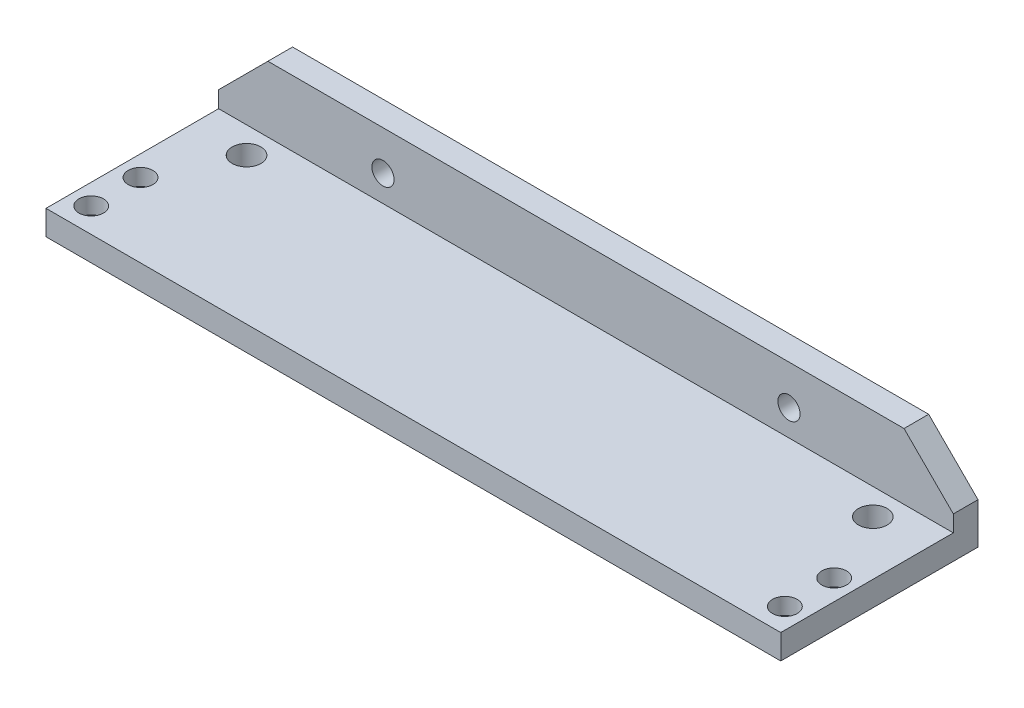
ISO-10303-21;
HEADER;
FILE_DESCRIPTION(('STEP AP214'),'2;1');
FILE_NAME('part.step','',(''),(''),'','','');
FILE_SCHEMA(('AUTOMOTIVE_DESIGN { 1 0 10303 214 1 1 1 1 }'));
ENDSEC;
DATA;
#1=APPLICATION_CONTEXT('core data for automotive mechanical design processes');
#2=APPLICATION_PROTOCOL_DEFINITION('international standard','automotive_design',2000,#1);
#3=PRODUCT_CONTEXT('',#1,'mechanical');
#4=PRODUCT('Part','Part','',(#3));
#5=PRODUCT_RELATED_PRODUCT_CATEGORY('part','',(#4));
#6=PRODUCT_DEFINITION_FORMATION('','',#4);
#7=PRODUCT_DEFINITION_CONTEXT('part definition',#1,'design');
#8=PRODUCT_DEFINITION('design','',#6,#7);
#9=PRODUCT_DEFINITION_SHAPE('','',#8);
#10=(LENGTH_UNIT() NAMED_UNIT(*) SI_UNIT(.MILLI.,.METRE.));
#11=(NAMED_UNIT(*) PLANE_ANGLE_UNIT() SI_UNIT($,.RADIAN.));
#12=(NAMED_UNIT(*) SI_UNIT($,.STERADIAN.) SOLID_ANGLE_UNIT());
#13=UNCERTAINTY_MEASURE_WITH_UNIT(LENGTH_MEASURE(1.E-05),#10,'distance_accuracy_value','');
#14=(GEOMETRIC_REPRESENTATION_CONTEXT(3) GLOBAL_UNCERTAINTY_ASSIGNED_CONTEXT((#13)) GLOBAL_UNIT_ASSIGNED_CONTEXT((#10,
#11,#12)) REPRESENTATION_CONTEXT('',''));
#15=CARTESIAN_POINT('',(0.,0.,0.));
#16=DIRECTION('',(0.,0.,1.));
#17=DIRECTION('',(1.,0.,0.));
#18=AXIS2_PLACEMENT_3D('',#15,#16,#17);
#19=CARTESIAN_POINT('',(0.,-2.10740038617406,24.));
#20=DIRECTION('',(0.,1.,0.));
#21=DIRECTION('',(0.,0.,1.));
#22=AXIS2_PLACEMENT_3D('',#19,#20,#21);
#23=PLANE('',#22);
#24=CARTESIAN_POINT('',(48.6489300998573,-2.10740038617406,15.));
#25=DIRECTION('',(0.,1.,0.));
#26=DIRECTION('',(0.,0.,1.));
#27=AXIS2_PLACEMENT_3D('',#24,#25,#26);
#28=CIRCLE('',#27,2.25);
#29=CARTESIAN_POINT('',(48.6489300998573,-2.10740038617406,17.25));
#30=VERTEX_POINT('',#29);
#31=EDGE_CURVE('E599',#30,#30,#28,.T.);
#32=ORIENTED_EDGE('',*,*,#31,.T.);
#33=EDGE_LOOP('',(#32));
#34=FACE_BOUND('',#33,.T.);
#35=CARTESIAN_POINT('',(-35.7510699001427,-2.10740038617406,15.));
#36=DIRECTION('',(0.,1.,0.));
#37=DIRECTION('',(0.,0.,1.));
#38=AXIS2_PLACEMENT_3D('',#35,#36,#37);
#39=CIRCLE('',#38,2.25);
#40=CARTESIAN_POINT('',(-35.7510699001427,-2.10740038617406,17.25));
#41=VERTEX_POINT('',#40);
#42=EDGE_CURVE('E159',#41,#41,#39,.T.);
#43=ORIENTED_EDGE('',*,*,#42,.T.);
#44=EDGE_LOOP('',(#43));
#45=FACE_BOUND('',#44,.T.);
#46=CARTESIAN_POINT('',(44.5489300998573,-2.10740038617406,6.2));
#47=DIRECTION('',(0.,1.,0.));
#48=DIRECTION('',(0.,0.,1.));
#49=AXIS2_PLACEMENT_3D('',#46,#47,#48);
#50=CIRCLE('',#49,1.75);
#51=CARTESIAN_POINT('',(44.5489300998573,-2.10740038617406,7.95));
#52=VERTEX_POINT('',#51);
#53=EDGE_CURVE('E174',#52,#52,#50,.F.);
#54=ORIENTED_EDGE('',*,*,#53,.F.);
#55=EDGE_LOOP('',(#54));
#56=FACE_BOUND('',#55,.T.);
#57=CARTESIAN_POINT('',(-31.6510699001427,-2.10740038617406,6.2));
#58=DIRECTION('',(0.,1.,0.));
#59=DIRECTION('',(0.,0.,1.));
#60=AXIS2_PLACEMENT_3D('',#57,#58,#59);
#61=CIRCLE('',#60,1.75);
#62=CARTESIAN_POINT('',(-31.6510699001427,-2.10740038617406,7.95));
#63=VERTEX_POINT('',#62);
#64=EDGE_CURVE('E157',#63,#63,#61,.F.);
#65=ORIENTED_EDGE('',*,*,#64,.F.);
#66=EDGE_LOOP('',(#65));
#67=FACE_BOUND('',#66,.T.);
#68=DIRECTION('',(1.,0.,0.));
#69=VECTOR('',#68,1.);
#70=CARTESIAN_POINT('',(0.,-2.10740038617406,0.));
#71=LINE('',#70,#69);
#72=CARTESIAN_POINT('',(-38.2510699001427,-2.10740038617406,0.));
#73=VERTEX_POINT('',#72);
#74=CARTESIAN_POINT('',(51.1489300998573,-2.10740038617406,0.));
#75=VERTEX_POINT('',#74);
#76=EDGE_CURVE('E192',#73,#75,#71,.T.);
#77=ORIENTED_EDGE('',*,*,#76,.T.);
#78=DIRECTION('',(0.,0.,-1.));
#79=VECTOR('',#78,1.);
#80=CARTESIAN_POINT('',(51.1489300998573,-2.10740038617406,24.));
#81=LINE('',#80,#79);
#82=CARTESIAN_POINT('',(51.1489300998573,-2.10740038617406,24.));
#83=VERTEX_POINT('',#82);
#84=EDGE_CURVE('E136',#83,#75,#81,.T.);
#85=ORIENTED_EDGE('',*,*,#84,.F.);
#86=DIRECTION('',(1.,0.,0.));
#87=VECTOR('',#86,1.);
#88=CARTESIAN_POINT('',(0.,-2.10740038617406,24.));
#89=LINE('',#88,#87);
#90=CARTESIAN_POINT('',(-38.2510699001427,-2.10740038617406,24.));
#91=VERTEX_POINT('',#90);
#92=EDGE_CURVE('E193',#91,#83,#89,.T.);
#93=ORIENTED_EDGE('',*,*,#92,.F.);
#94=DIRECTION('',(0.,0.,-1.));
#95=VECTOR('',#94,1.);
#96=CARTESIAN_POINT('',(-38.2510699001427,-2.10740038617406,24.));
#97=LINE('',#96,#95);
#98=EDGE_CURVE('E204',#91,#73,#97,.T.);
#99=ORIENTED_EDGE('',*,*,#98,.T.);
#100=EDGE_LOOP('',(#77,#85,#93,#99));
#101=FACE_BOUND('',#100,.T.);
#102=CARTESIAN_POINT('',(48.6489300998573,-2.10740038617406,21.));
#103=DIRECTION('',(0.,1.,0.));
#104=DIRECTION('',(0.,0.,1.));
#105=AXIS2_PLACEMENT_3D('',#102,#103,#104);
#106=CIRCLE('',#105,2.25);
#107=CARTESIAN_POINT('',(48.6489300998573,-2.10740038617406,23.25));
#108=VERTEX_POINT('',#107);
#109=EDGE_CURVE('E602',#108,#108,#106,.T.);
#110=ORIENTED_EDGE('',*,*,#109,.T.);
#111=EDGE_LOOP('',(#110));
#112=FACE_BOUND('',#111,.T.);
#113=CARTESIAN_POINT('',(-35.7510699001427,-2.10740038617406,21.));
#114=DIRECTION('',(0.,1.,0.));
#115=DIRECTION('',(0.,0.,1.));
#116=AXIS2_PLACEMENT_3D('',#113,#114,#115);
#117=CIRCLE('',#116,2.25);
#118=CARTESIAN_POINT('',(-35.7510699001427,-2.10740038617406,23.25));
#119=VERTEX_POINT('',#118);
#120=EDGE_CURVE('E590',#119,#119,#117,.T.);
#121=ORIENTED_EDGE('',*,*,#120,.T.);
#122=EDGE_LOOP('',(#121));
#123=FACE_BOUND('',#122,.T.);
#124=ADVANCED_FACE('F50',(#34,#45,#56,#67,#101,#112,#123),#23,.F.);
#125=CARTESIAN_POINT('',(51.1489300998573,0.,3.));
#126=DIRECTION('',(-1.,0.,0.));
#127=DIRECTION('',(0.,0.,1.));
#128=AXIS2_PLACEMENT_3D('',#125,#126,#127);
#129=PLANE('',#128);
#130=DIRECTION('',(0.,1.,0.));
#131=VECTOR('',#130,1.);
#132=CARTESIAN_POINT('',(51.1489300998573,0.,0.));
#133=LINE('',#132,#131);
#134=CARTESIAN_POINT('',(51.1489300998573,2.89259961382594,0.));
#135=VERTEX_POINT('',#134);
#136=EDGE_CURVE('E139',#75,#135,#133,.T.);
#137=ORIENTED_EDGE('',*,*,#136,.T.);
#138=DIRECTION('',(0.,0.,-1.));
#139=VECTOR('',#138,1.);
#140=CARTESIAN_POINT('',(51.1489300998573,2.89259961382594,3.));
#141=LINE('',#140,#139);
#142=CARTESIAN_POINT('',(51.1489300998573,2.89259961382594,3.));
#143=VERTEX_POINT('',#142);
#144=EDGE_CURVE('E12',#143,#135,#141,.T.);
#145=ORIENTED_EDGE('',*,*,#144,.F.);
#146=DIRECTION('',(0.,1.,0.));
#147=VECTOR('',#146,1.);
#148=CARTESIAN_POINT('',(51.1489300998573,0.,3.));
#149=LINE('',#148,#147);
#150=CARTESIAN_POINT('',(51.1489300998573,0.892599613825941,3.));
#151=VERTEX_POINT('',#150);
#152=EDGE_CURVE('E220',#151,#143,#149,.T.);
#153=ORIENTED_EDGE('',*,*,#152,.F.);
#154=DIRECTION('',(0.,0.,-1.));
#155=VECTOR('',#154,1.);
#156=CARTESIAN_POINT('',(51.1489300998573,0.892599613825941,24.));
#157=LINE('',#156,#155);
#158=CARTESIAN_POINT('',(51.1489300998573,0.892599613825941,24.));
#159=VERTEX_POINT('',#158);
#160=EDGE_CURVE('E69',#159,#151,#157,.T.);
#161=ORIENTED_EDGE('',*,*,#160,.F.);
#162=DIRECTION('',(0.,1.,0.));
#163=VECTOR('',#162,1.);
#164=CARTESIAN_POINT('',(51.1489300998573,0.,24.));
#165=LINE('',#164,#163);
#166=EDGE_CURVE('E196',#83,#159,#165,.T.);
#167=ORIENTED_EDGE('',*,*,#166,.F.);
#168=ORIENTED_EDGE('',*,*,#84,.T.);
#169=EDGE_LOOP('',(#137,#145,#153,#161,#167,#168));
#170=FACE_BOUND('',#169,.T.);
#171=ADVANCED_FACE('F224',(#170),#129,.F.);
#172=CARTESIAN_POINT('',(27.0207648568417,27.0207648568416,3.));
#173=DIRECTION('',(-0.707106781186548,-0.707106781186547,0.));
#174=DIRECTION('',(0.707106781186547,-0.707106781186548,0.));
#175=AXIS2_PLACEMENT_3D('',#172,#173,#174);
#176=PLANE('',#175);
#177=DIRECTION('',(-0.707106781186547,0.707106781186548,0.));
#178=VECTOR('',#177,1.);
#179=CARTESIAN_POINT('',(27.0207648568417,27.0207648568416,0.));
#180=LINE('',#179,#178);
#181=CARTESIAN_POINT('',(45.1489300998574,8.89259961382595,0.));
#182=VERTEX_POINT('',#181);
#183=EDGE_CURVE('E142',#135,#182,#180,.T.);
#184=ORIENTED_EDGE('',*,*,#183,.T.);
#185=DIRECTION('',(0.,0.,-1.));
#186=VECTOR('',#185,1.);
#187=CARTESIAN_POINT('',(45.1489300998574,8.89259961382595,3.));
#188=LINE('',#187,#186);
#189=CARTESIAN_POINT('',(45.1489300998574,8.89259961382595,3.));
#190=VERTEX_POINT('',#189);
#191=EDGE_CURVE('E60',#190,#182,#188,.T.);
#192=ORIENTED_EDGE('',*,*,#191,.F.);
#193=DIRECTION('',(-0.707106781186547,0.707106781186548,0.));
#194=VECTOR('',#193,1.);
#195=CARTESIAN_POINT('',(27.0207648568417,27.0207648568416,3.));
#196=LINE('',#195,#194);
#197=EDGE_CURVE('E103',#143,#190,#196,.T.);
#198=ORIENTED_EDGE('',*,*,#197,.F.);
#199=ORIENTED_EDGE('',*,*,#144,.T.);
#200=EDGE_LOOP('',(#184,#192,#198,#199));
#201=FACE_BOUND('',#200,.T.);
#202=ADVANCED_FACE('F226',(#201),#176,.F.);
#203=CARTESIAN_POINT('',(0.,8.89259961382594,3.));
#204=DIRECTION('',(0.,-1.,0.));
#205=DIRECTION('',(1.,0.,0.));
#206=AXIS2_PLACEMENT_3D('',#203,#204,#205);
#207=PLANE('',#206);
#208=DIRECTION('',(-1.,0.,0.));
#209=VECTOR('',#208,1.);
#210=CARTESIAN_POINT('',(0.,8.89259961382594,0.));
#211=LINE('',#210,#209);
#212=CARTESIAN_POINT('',(-32.2510699001427,8.89259961382594,0.));
#213=VERTEX_POINT('',#212);
#214=EDGE_CURVE('E121',#182,#213,#211,.T.);
#215=ORIENTED_EDGE('',*,*,#214,.T.);
#216=DIRECTION('',(0.,0.,-1.));
#217=VECTOR('',#216,1.);
#218=CARTESIAN_POINT('',(-32.2510699001427,8.89259961382594,3.));
#219=LINE('',#218,#217);
#220=CARTESIAN_POINT('',(-32.2510699001427,8.89259961382594,3.));
#221=VERTEX_POINT('',#220);
#222=EDGE_CURVE('E88',#221,#213,#219,.T.);
#223=ORIENTED_EDGE('',*,*,#222,.F.);
#224=DIRECTION('',(-1.,0.,0.));
#225=VECTOR('',#224,1.);
#226=CARTESIAN_POINT('',(0.,8.89259961382594,3.));
#227=LINE('',#226,#225);
#228=EDGE_CURVE('E112',#190,#221,#227,.T.);
#229=ORIENTED_EDGE('',*,*,#228,.F.);
#230=ORIENTED_EDGE('',*,*,#191,.T.);
#231=EDGE_LOOP('',(#215,#223,#229,#230));
#232=FACE_BOUND('',#231,.T.);
#233=ADVANCED_FACE('F119',(#232),#207,.F.);
#234=CARTESIAN_POINT('',(-20.5718347569843,20.5718347569843,3.));
#235=DIRECTION('',(-0.707106781186548,0.707106781186547,0.));
#236=DIRECTION('',(-0.707106781186547,-0.707106781186548,0.));
#237=AXIS2_PLACEMENT_3D('',#234,#235,#236);
#238=PLANE('',#237);
#239=DIRECTION('',(0.707106781186547,0.707106781186548,0.));
#240=VECTOR('',#239,1.);
#241=CARTESIAN_POINT('',(-20.5718347569843,20.5718347569843,0.));
#242=LINE('',#241,#240);
#243=CARTESIAN_POINT('',(-38.2510699001427,2.89259961382594,0.));
#244=VERTEX_POINT('',#243);
#245=EDGE_CURVE('E145',#244,#213,#242,.T.);
#246=ORIENTED_EDGE('',*,*,#245,.F.);
#247=DIRECTION('',(0.,0.,-1.));
#248=VECTOR('',#247,1.);
#249=CARTESIAN_POINT('',(-38.2510699001427,2.89259961382594,3.));
#250=LINE('',#249,#248);
#251=CARTESIAN_POINT('',(-38.2510699001427,2.89259961382594,3.));
#252=VERTEX_POINT('',#251);
#253=EDGE_CURVE('E95',#252,#244,#250,.T.);
#254=ORIENTED_EDGE('',*,*,#253,.F.);
#255=DIRECTION('',(0.707106781186547,0.707106781186548,0.));
#256=VECTOR('',#255,1.);
#257=CARTESIAN_POINT('',(-20.5718347569843,20.5718347569843,3.));
#258=LINE('',#257,#256);
#259=EDGE_CURVE('E115',#252,#221,#258,.T.);
#260=ORIENTED_EDGE('',*,*,#259,.T.);
#261=ORIENTED_EDGE('',*,*,#222,.T.);
#262=EDGE_LOOP('',(#246,#254,#260,#261));
#263=FACE_BOUND('',#262,.T.);
#264=ADVANCED_FACE('F124',(#263),#238,.T.);
#265=CARTESIAN_POINT('',(-38.2510699001427,0.,3.));
#266=DIRECTION('',(1.,0.,0.));
#267=DIRECTION('',(0.,0.,-1.));
#268=AXIS2_PLACEMENT_3D('',#265,#266,#267);
#269=PLANE('',#268);
#270=DIRECTION('',(0.,-1.,0.));
#271=VECTOR('',#270,1.);
#272=CARTESIAN_POINT('',(-38.2510699001427,0.,0.));
#273=LINE('',#272,#271);
#274=EDGE_CURVE('E147',#244,#73,#273,.T.);
#275=ORIENTED_EDGE('',*,*,#274,.T.);
#276=ORIENTED_EDGE('',*,*,#98,.F.);
#277=DIRECTION('',(0.,-1.,0.));
#278=VECTOR('',#277,1.);
#279=CARTESIAN_POINT('',(-38.2510699001427,0.,24.));
#280=LINE('',#279,#278);
#281=CARTESIAN_POINT('',(-38.2510699001427,0.892599613825941,24.));
#282=VERTEX_POINT('',#281);
#283=EDGE_CURVE('E201',#282,#91,#280,.T.);
#284=ORIENTED_EDGE('',*,*,#283,.F.);
#285=DIRECTION('',(0.,0.,-1.));
#286=VECTOR('',#285,1.);
#287=CARTESIAN_POINT('',(-38.2510699001427,0.892599613825941,24.));
#288=LINE('',#287,#286);
#289=CARTESIAN_POINT('',(-38.2510699001427,0.892599613825941,3.));
#290=VERTEX_POINT('',#289);
#291=EDGE_CURVE('E209',#282,#290,#288,.T.);
#292=ORIENTED_EDGE('',*,*,#291,.T.);
#293=DIRECTION('',(0.,-1.,0.));
#294=VECTOR('',#293,1.);
#295=CARTESIAN_POINT('',(-38.2510699001427,0.,3.));
#296=LINE('',#295,#294);
#297=EDGE_CURVE('E125',#252,#290,#296,.T.);
#298=ORIENTED_EDGE('',*,*,#297,.F.);
#299=ORIENTED_EDGE('',*,*,#253,.T.);
#300=EDGE_LOOP('',(#275,#276,#284,#292,#298,#299));
#301=FACE_BOUND('',#300,.T.);
#302=ADVANCED_FACE('F232',(#301),#269,.F.);
#303=CARTESIAN_POINT('',(-18.2510699001427,4.09259961382594,3.));
#304=DIRECTION('',(0.,0.,-1.));
#305=DIRECTION('',(-1.,0.,0.));
#306=AXIS2_PLACEMENT_3D('',#303,#304,#305);
#307=CYLINDRICAL_SURFACE('',#306,1.35);
#308=CARTESIAN_POINT('',(-18.2510699001427,4.09259961382594,3.));
#309=DIRECTION('',(0.,0.,1.));
#310=DIRECTION('',(1.,0.,0.));
#311=AXIS2_PLACEMENT_3D('',#308,#309,#310);
#312=CIRCLE('',#311,1.35);
#313=CARTESIAN_POINT('',(-16.9010699001427,4.09259961382594,3.));
#314=VERTEX_POINT('',#313);
#315=EDGE_CURVE('E217',#314,#314,#312,.T.);
#316=ORIENTED_EDGE('',*,*,#315,.T.);
#317=EDGE_LOOP('',(#316));
#318=FACE_BOUND('',#317,.T.);
#319=CARTESIAN_POINT('',(-18.2510699001427,4.09259961382594,0.));
#320=DIRECTION('',(0.,0.,1.));
#321=DIRECTION('',(1.,0.,0.));
#322=AXIS2_PLACEMENT_3D('',#319,#320,#321);
#323=CIRCLE('',#322,1.35);
#324=CARTESIAN_POINT('',(-16.9010699001427,4.09259961382594,0.));
#325=VERTEX_POINT('',#324);
#326=EDGE_CURVE('E135',#325,#325,#323,.T.);
#327=ORIENTED_EDGE('',*,*,#326,.F.);
#328=EDGE_LOOP('',(#327));
#329=FACE_BOUND('',#328,.T.);
#330=ADVANCED_FACE('F282',(#318,#329),#307,.F.);
#331=CARTESIAN_POINT('',(31.1489300998573,4.09259961382594,3.));
#332=DIRECTION('',(0.,0.,-1.));
#333=DIRECTION('',(-1.,0.,0.));
#334=AXIS2_PLACEMENT_3D('',#331,#332,#333);
#335=CYLINDRICAL_SURFACE('',#334,1.35000000000001);
#336=CARTESIAN_POINT('',(31.1489300998573,4.09259961382594,3.));
#337=DIRECTION('',(0.,0.,1.));
#338=DIRECTION('',(1.,0.,0.));
#339=AXIS2_PLACEMENT_3D('',#336,#337,#338);
#340=CIRCLE('',#339,1.35000000000001);
#341=CARTESIAN_POINT('',(32.4989300998573,4.09259961382594,3.));
#342=VERTEX_POINT('',#341);
#343=EDGE_CURVE('E149',#342,#342,#340,.T.);
#344=ORIENTED_EDGE('',*,*,#343,.T.);
#345=EDGE_LOOP('',(#344));
#346=FACE_BOUND('',#345,.T.);
#347=CARTESIAN_POINT('',(31.1489300998573,4.09259961382594,0.));
#348=DIRECTION('',(0.,0.,1.));
#349=DIRECTION('',(1.,0.,0.));
#350=AXIS2_PLACEMENT_3D('',#347,#348,#349);
#351=CIRCLE('',#350,1.35000000000001);
#352=CARTESIAN_POINT('',(32.4989300998573,4.09259961382594,0.));
#353=VERTEX_POINT('',#352);
#354=EDGE_CURVE('E132',#353,#353,#351,.T.);
#355=ORIENTED_EDGE('',*,*,#354,.F.);
#356=EDGE_LOOP('',(#355));
#357=FACE_BOUND('',#356,.T.);
#358=ADVANCED_FACE('F52',(#346,#357),#335,.F.);
#359=CARTESIAN_POINT('',(0.,0.,3.));
#360=DIRECTION('',(0.,0.,1.));
#361=DIRECTION('',(1.,0.,0.));
#362=AXIS2_PLACEMENT_3D('',#359,#360,#361);
#363=PLANE('',#362);
#364=ORIENTED_EDGE('',*,*,#343,.F.);
#365=EDGE_LOOP('',(#364));
#366=FACE_BOUND('',#365,.T.);
#367=ORIENTED_EDGE('',*,*,#315,.F.);
#368=EDGE_LOOP('',(#367));
#369=FACE_BOUND('',#368,.T.);
#370=ORIENTED_EDGE('',*,*,#152,.T.);
#371=ORIENTED_EDGE('',*,*,#197,.T.);
#372=ORIENTED_EDGE('',*,*,#228,.T.);
#373=ORIENTED_EDGE('',*,*,#259,.F.);
#374=ORIENTED_EDGE('',*,*,#297,.T.);
#375=DIRECTION('',(1.,0.,0.));
#376=VECTOR('',#375,1.);
#377=CARTESIAN_POINT('',(0.,0.892599613825941,3.));
#378=LINE('',#377,#376);
#379=EDGE_CURVE('E127',#290,#151,#378,.T.);
#380=ORIENTED_EDGE('',*,*,#379,.T.);
#381=EDGE_LOOP('',(#370,#371,#372,#373,#374,#380));
#382=FACE_BOUND('',#381,.T.);
#383=ADVANCED_FACE('F113',(#366,#369,#382),#363,.T.);
#384=CARTESIAN_POINT('',(0.,0.,0.));
#385=DIRECTION('',(0.,0.,1.));
#386=DIRECTION('',(1.,0.,0.));
#387=AXIS2_PLACEMENT_3D('',#384,#385,#386);
#388=PLANE('',#387);
#389=ORIENTED_EDGE('',*,*,#354,.T.);
#390=EDGE_LOOP('',(#389));
#391=FACE_BOUND('',#390,.T.);
#392=ORIENTED_EDGE('',*,*,#326,.T.);
#393=EDGE_LOOP('',(#392));
#394=FACE_BOUND('',#393,.T.);
#395=ORIENTED_EDGE('',*,*,#136,.F.);
#396=ORIENTED_EDGE('',*,*,#76,.F.);
#397=ORIENTED_EDGE('',*,*,#274,.F.);
#398=ORIENTED_EDGE('',*,*,#245,.T.);
#399=ORIENTED_EDGE('',*,*,#214,.F.);
#400=ORIENTED_EDGE('',*,*,#183,.F.);
#401=EDGE_LOOP('',(#395,#396,#397,#398,#399,#400));
#402=FACE_BOUND('',#401,.T.);
#403=ADVANCED_FACE('F228',(#391,#394,#402),#388,.F.);
#404=CARTESIAN_POINT('',(0.,0.892599613825941,24.));
#405=DIRECTION('',(0.,1.,0.));
#406=DIRECTION('',(0.,0.,1.));
#407=AXIS2_PLACEMENT_3D('',#404,#405,#406);
#408=PLANE('',#407);
#409=CARTESIAN_POINT('',(44.5489300998573,0.892599613825941,6.2));
#410=DIRECTION('',(0.,1.,0.));
#411=DIRECTION('',(0.,0.,1.));
#412=AXIS2_PLACEMENT_3D('',#409,#410,#411);
#413=CIRCLE('',#412,1.75);
#414=CARTESIAN_POINT('',(44.5489300998573,0.892599613825941,7.95));
#415=VERTEX_POINT('',#414);
#416=EDGE_CURVE('E179',#415,#415,#413,.T.);
#417=ORIENTED_EDGE('',*,*,#416,.F.);
#418=EDGE_LOOP('',(#417));
#419=FACE_BOUND('',#418,.T.);
#420=CARTESIAN_POINT('',(-35.7510699001427,0.892599613825941,21.));
#421=DIRECTION('',(0.,1.,0.));
#422=DIRECTION('',(0.,0.,1.));
#423=AXIS2_PLACEMENT_3D('',#420,#421,#422);
#424=CIRCLE('',#423,1.5);
#425=CARTESIAN_POINT('',(-35.7510699001427,0.892599613825941,22.5));
#426=VERTEX_POINT('',#425);
#427=EDGE_CURVE('E175',#426,#426,#424,.T.);
#428=ORIENTED_EDGE('',*,*,#427,.F.);
#429=EDGE_LOOP('',(#428));
#430=FACE_BOUND('',#429,.T.);
#431=CARTESIAN_POINT('',(-35.7510699001427,0.892599613825941,15.));
#432=DIRECTION('',(0.,1.,0.));
#433=DIRECTION('',(0.,0.,1.));
#434=AXIS2_PLACEMENT_3D('',#431,#432,#433);
#435=CIRCLE('',#434,1.5);
#436=CARTESIAN_POINT('',(-35.7510699001427,0.892599613825941,16.5));
#437=VERTEX_POINT('',#436);
#438=EDGE_CURVE('E178',#437,#437,#435,.T.);
#439=ORIENTED_EDGE('',*,*,#438,.F.);
#440=EDGE_LOOP('',(#439));
#441=FACE_BOUND('',#440,.T.);
#442=CARTESIAN_POINT('',(48.6489300998573,0.892599613825941,21.));
#443=DIRECTION('',(0.,1.,0.));
#444=DIRECTION('',(0.,0.,1.));
#445=AXIS2_PLACEMENT_3D('',#442,#443,#444);
#446=CIRCLE('',#445,1.5);
#447=CARTESIAN_POINT('',(48.6489300998573,0.892599613825941,22.5));
#448=VERTEX_POINT('',#447);
#449=EDGE_CURVE('E184',#448,#448,#446,.T.);
#450=ORIENTED_EDGE('',*,*,#449,.F.);
#451=EDGE_LOOP('',(#450));
#452=FACE_BOUND('',#451,.T.);
#453=CARTESIAN_POINT('',(-31.6510699001427,0.892599613825941,6.2));
#454=DIRECTION('',(0.,1.,0.));
#455=DIRECTION('',(0.,0.,1.));
#456=AXIS2_PLACEMENT_3D('',#453,#454,#455);
#457=CIRCLE('',#456,1.75);
#458=CARTESIAN_POINT('',(-31.6510699001427,0.892599613825941,7.95));
#459=VERTEX_POINT('',#458);
#460=EDGE_CURVE('E171',#459,#459,#457,.T.);
#461=ORIENTED_EDGE('',*,*,#460,.F.);
#462=EDGE_LOOP('',(#461));
#463=FACE_BOUND('',#462,.T.);
#464=CARTESIAN_POINT('',(48.6489300998573,0.892599613825941,15.));
#465=DIRECTION('',(0.,1.,0.));
#466=DIRECTION('',(0.,0.,1.));
#467=AXIS2_PLACEMENT_3D('',#464,#465,#466);
#468=CIRCLE('',#467,1.5);
#469=CARTESIAN_POINT('',(48.6489300998573,0.892599613825941,16.5));
#470=VERTEX_POINT('',#469);
#471=EDGE_CURVE('E187',#470,#470,#468,.T.);
#472=ORIENTED_EDGE('',*,*,#471,.F.);
#473=EDGE_LOOP('',(#472));
#474=FACE_BOUND('',#473,.T.);
#475=ORIENTED_EDGE('',*,*,#379,.F.);
#476=ORIENTED_EDGE('',*,*,#291,.F.);
#477=DIRECTION('',(1.,0.,0.));
#478=VECTOR('',#477,1.);
#479=CARTESIAN_POINT('',(0.,0.892599613825941,24.));
#480=LINE('',#479,#478);
#481=EDGE_CURVE('E199',#282,#159,#480,.T.);
#482=ORIENTED_EDGE('',*,*,#481,.T.);
#483=ORIENTED_EDGE('',*,*,#160,.T.);
#484=EDGE_LOOP('',(#475,#476,#482,#483));
#485=FACE_BOUND('',#484,.T.);
#486=ADVANCED_FACE('F253',(#419,#430,#441,#452,#463,#474,#485),#408,.T.);
#487=CARTESIAN_POINT('',(0.,0.,24.));
#488=DIRECTION('',(0.,0.,1.));
#489=DIRECTION('',(1.,0.,0.));
#490=AXIS2_PLACEMENT_3D('',#487,#488,#489);
#491=PLANE('',#490);
#492=ORIENTED_EDGE('',*,*,#92,.T.);
#493=ORIENTED_EDGE('',*,*,#166,.T.);
#494=ORIENTED_EDGE('',*,*,#481,.F.);
#495=ORIENTED_EDGE('',*,*,#283,.T.);
#496=EDGE_LOOP('',(#492,#493,#494,#495));
#497=FACE_BOUND('',#496,.T.);
#498=ADVANCED_FACE('F244',(#497),#491,.T.);
#499=CARTESIAN_POINT('',(48.6489300998573,-2.10840038617406,15.));
#500=DIRECTION('',(0.,1.,0.));
#501=DIRECTION('',(0.,0.,1.));
#502=AXIS2_PLACEMENT_3D('',#499,#500,#501);
#503=CYLINDRICAL_SURFACE('',#502,1.5);
#504=CARTESIAN_POINT('',(48.6489300998573,-1.10740038617406,15.));
#505=DIRECTION('',(0.,1.,0.));
#506=DIRECTION('',(0.,0.,1.));
#507=AXIS2_PLACEMENT_3D('',#504,#505,#506);
#508=CIRCLE('',#507,1.5);
#509=CARTESIAN_POINT('',(48.6489300998573,-1.10740038617406,16.5));
#510=VERTEX_POINT('',#509);
#511=EDGE_CURVE('E54',#510,#510,#508,.F.);
#512=ORIENTED_EDGE('',*,*,#511,.T.);
#513=EDGE_LOOP('',(#512));
#514=FACE_BOUND('',#513,.T.);
#515=ORIENTED_EDGE('',*,*,#471,.T.);
#516=EDGE_LOOP('',(#515));
#517=FACE_BOUND('',#516,.T.);
#518=ADVANCED_FACE('F261',(#514,#517),#503,.F.);
#519=CARTESIAN_POINT('',(-31.6510699001427,-2.10840038617406,6.2));
#520=DIRECTION('',(0.,1.,0.));
#521=DIRECTION('',(0.,0.,1.));
#522=AXIS2_PLACEMENT_3D('',#519,#520,#521);
#523=CYLINDRICAL_SURFACE('',#522,1.75);
#524=ORIENTED_EDGE('',*,*,#460,.T.);
#525=EDGE_LOOP('',(#524));
#526=FACE_BOUND('',#525,.T.);
#527=ORIENTED_EDGE('',*,*,#64,.T.);
#528=EDGE_LOOP('',(#527));
#529=FACE_BOUND('',#528,.T.);
#530=ADVANCED_FACE('F449',(#526,#529),#523,.F.);
#531=CARTESIAN_POINT('',(48.6489300998573,-2.10840038617406,21.));
#532=DIRECTION('',(0.,1.,0.));
#533=DIRECTION('',(0.,0.,1.));
#534=AXIS2_PLACEMENT_3D('',#531,#532,#533);
#535=CYLINDRICAL_SURFACE('',#534,1.5);
#536=CARTESIAN_POINT('',(48.6489300998573,-1.10740038617406,21.));
#537=DIRECTION('',(0.,1.,0.));
#538=DIRECTION('',(0.,0.,1.));
#539=AXIS2_PLACEMENT_3D('',#536,#537,#538);
#540=CIRCLE('',#539,1.5);
#541=CARTESIAN_POINT('',(48.6489300998573,-1.10740038617406,22.5));
#542=VERTEX_POINT('',#541);
#543=EDGE_CURVE('E151',#542,#542,#540,.F.);
#544=ORIENTED_EDGE('',*,*,#543,.T.);
#545=EDGE_LOOP('',(#544));
#546=FACE_BOUND('',#545,.T.);
#547=ORIENTED_EDGE('',*,*,#449,.T.);
#548=EDGE_LOOP('',(#547));
#549=FACE_BOUND('',#548,.T.);
#550=ADVANCED_FACE('F441',(#546,#549),#535,.F.);
#551=CARTESIAN_POINT('',(-35.7510699001427,-2.10840038617406,15.));
#552=DIRECTION('',(0.,1.,0.));
#553=DIRECTION('',(0.,0.,1.));
#554=AXIS2_PLACEMENT_3D('',#551,#552,#553);
#555=CYLINDRICAL_SURFACE('',#554,1.5);
#556=CARTESIAN_POINT('',(-35.7510699001427,-1.10740038617406,15.));
#557=DIRECTION('',(0.,1.,0.));
#558=DIRECTION('',(0.,0.,1.));
#559=AXIS2_PLACEMENT_3D('',#556,#557,#558);
#560=CIRCLE('',#559,1.5);
#561=CARTESIAN_POINT('',(-35.7510699001427,-1.10740038617406,16.5));
#562=VERTEX_POINT('',#561);
#563=EDGE_CURVE('E164',#562,#562,#560,.T.);
#564=ORIENTED_EDGE('',*,*,#563,.F.);
#565=EDGE_LOOP('',(#564));
#566=FACE_BOUND('',#565,.T.);
#567=ORIENTED_EDGE('',*,*,#438,.T.);
#568=EDGE_LOOP('',(#567));
#569=FACE_BOUND('',#568,.T.);
#570=ADVANCED_FACE('F431',(#566,#569),#555,.F.);
#571=CARTESIAN_POINT('',(-35.7510699001427,-2.10840038617406,21.));
#572=DIRECTION('',(0.,1.,0.));
#573=DIRECTION('',(0.,0.,1.));
#574=AXIS2_PLACEMENT_3D('',#571,#572,#573);
#575=CYLINDRICAL_SURFACE('',#574,1.5);
#576=CARTESIAN_POINT('',(-35.7510699001427,-1.10740038617406,21.));
#577=DIRECTION('',(0.,1.,0.));
#578=DIRECTION('',(0.,0.,1.));
#579=AXIS2_PLACEMENT_3D('',#576,#577,#578);
#580=CIRCLE('',#579,1.5);
#581=CARTESIAN_POINT('',(-35.7510699001427,-1.10740038617406,22.5));
#582=VERTEX_POINT('',#581);
#583=EDGE_CURVE('E588',#582,#582,#580,.T.);
#584=ORIENTED_EDGE('',*,*,#583,.F.);
#585=EDGE_LOOP('',(#584));
#586=FACE_BOUND('',#585,.T.);
#587=ORIENTED_EDGE('',*,*,#427,.T.);
#588=EDGE_LOOP('',(#587));
#589=FACE_BOUND('',#588,.T.);
#590=ADVANCED_FACE('F427',(#586,#589),#575,.F.);
#591=CARTESIAN_POINT('',(44.5489300998573,-2.10840038617406,6.2));
#592=DIRECTION('',(0.,1.,0.));
#593=DIRECTION('',(0.,0.,1.));
#594=AXIS2_PLACEMENT_3D('',#591,#592,#593);
#595=CYLINDRICAL_SURFACE('',#594,1.75);
#596=ORIENTED_EDGE('',*,*,#416,.T.);
#597=EDGE_LOOP('',(#596));
#598=FACE_BOUND('',#597,.T.);
#599=ORIENTED_EDGE('',*,*,#53,.T.);
#600=EDGE_LOOP('',(#599));
#601=FACE_BOUND('',#600,.T.);
#602=ADVANCED_FACE('F327',(#598,#601),#595,.F.);
#603=CARTESIAN_POINT('',(-35.7510699001427,-1.10740038617406,21.));
#604=DIRECTION('',(0.,1.,0.));
#605=DIRECTION('',(0.,0.,1.));
#606=AXIS2_PLACEMENT_3D('',#603,#604,#605);
#607=PLANE('',#606);
#608=CARTESIAN_POINT('',(-35.7510699001427,-1.10740038617406,21.));
#609=DIRECTION('',(0.,1.,0.));
#610=DIRECTION('',(0.,0.,1.));
#611=AXIS2_PLACEMENT_3D('',#608,#609,#610);
#612=CIRCLE('',#611,2.25);
#613=CARTESIAN_POINT('',(-35.7510699001427,-1.10740038617406,23.25));
#614=VERTEX_POINT('',#613);
#615=EDGE_CURVE('E595',#614,#614,#612,.T.);
#616=ORIENTED_EDGE('',*,*,#615,.F.);
#617=EDGE_LOOP('',(#616));
#618=FACE_BOUND('',#617,.T.);
#619=ORIENTED_EDGE('',*,*,#583,.T.);
#620=EDGE_LOOP('',(#619));
#621=FACE_BOUND('',#620,.T.);
#622=ADVANCED_FACE('F321',(#618,#621),#607,.F.);
#623=CARTESIAN_POINT('',(-35.7510699001427,-1.10740038617406,21.));
#624=DIRECTION('',(0.,-1.,0.));
#625=DIRECTION('',(0.,0.,-1.));
#626=AXIS2_PLACEMENT_3D('',#623,#624,#625);
#627=CYLINDRICAL_SURFACE('',#626,2.25);
#628=ORIENTED_EDGE('',*,*,#615,.T.);
#629=EDGE_LOOP('',(#628));
#630=FACE_BOUND('',#629,.T.);
#631=ORIENTED_EDGE('',*,*,#120,.F.);
#632=EDGE_LOOP('',(#631));
#633=FACE_BOUND('',#632,.T.);
#634=ADVANCED_FACE('F326',(#630,#633),#627,.F.);
#635=CARTESIAN_POINT('',(-35.7510699001427,-1.10740038617406,15.));
#636=DIRECTION('',(0.,1.,0.));
#637=DIRECTION('',(0.,0.,1.));
#638=AXIS2_PLACEMENT_3D('',#635,#636,#637);
#639=PLANE('',#638);
#640=CARTESIAN_POINT('',(-35.7510699001427,-1.10740038617406,15.));
#641=DIRECTION('',(0.,1.,0.));
#642=DIRECTION('',(0.,0.,1.));
#643=AXIS2_PLACEMENT_3D('',#640,#641,#642);
#644=CIRCLE('',#643,2.25);
#645=CARTESIAN_POINT('',(-35.7510699001427,-1.10740038617406,17.25));
#646=VERTEX_POINT('',#645);
#647=EDGE_CURVE('E153',#646,#646,#644,.T.);
#648=ORIENTED_EDGE('',*,*,#647,.F.);
#649=EDGE_LOOP('',(#648));
#650=FACE_BOUND('',#649,.T.);
#651=ORIENTED_EDGE('',*,*,#563,.T.);
#652=EDGE_LOOP('',(#651));
#653=FACE_BOUND('',#652,.T.);
#654=ADVANCED_FACE('F337',(#650,#653),#639,.F.);
#655=CARTESIAN_POINT('',(-35.7510699001427,-1.10740038617406,15.));
#656=DIRECTION('',(0.,-1.,0.));
#657=DIRECTION('',(0.,0.,-1.));
#658=AXIS2_PLACEMENT_3D('',#655,#656,#657);
#659=CYLINDRICAL_SURFACE('',#658,2.25);
#660=ORIENTED_EDGE('',*,*,#647,.T.);
#661=EDGE_LOOP('',(#660));
#662=FACE_BOUND('',#661,.T.);
#663=ORIENTED_EDGE('',*,*,#42,.F.);
#664=EDGE_LOOP('',(#663));
#665=FACE_BOUND('',#664,.T.);
#666=ADVANCED_FACE('F342',(#662,#665),#659,.F.);
#667=CARTESIAN_POINT('',(48.6489300998573,-1.10740038617406,21.));
#668=DIRECTION('',(0.,1.,0.));
#669=DIRECTION('',(0.,0.,1.));
#670=AXIS2_PLACEMENT_3D('',#667,#668,#669);
#671=PLANE('',#670);
#672=CARTESIAN_POINT('',(48.6489300998573,-1.10740038617406,21.));
#673=DIRECTION('',(0.,1.,0.));
#674=DIRECTION('',(0.,0.,1.));
#675=AXIS2_PLACEMENT_3D('',#672,#673,#674);
#676=CIRCLE('',#675,2.25);
#677=CARTESIAN_POINT('',(48.6489300998573,-1.10740038617406,23.25));
#678=VERTEX_POINT('',#677);
#679=EDGE_CURVE('E605',#678,#678,#676,.T.);
#680=ORIENTED_EDGE('',*,*,#679,.F.);
#681=EDGE_LOOP('',(#680));
#682=FACE_BOUND('',#681,.T.);
#683=ORIENTED_EDGE('',*,*,#543,.F.);
#684=EDGE_LOOP('',(#683));
#685=FACE_BOUND('',#684,.T.);
#686=ADVANCED_FACE('F366',(#682,#685),#671,.F.);
#687=CARTESIAN_POINT('',(48.6489300998573,-1.10740038617406,21.));
#688=DIRECTION('',(0.,-1.,0.));
#689=DIRECTION('',(0.,0.,-1.));
#690=AXIS2_PLACEMENT_3D('',#687,#688,#689);
#691=CYLINDRICAL_SURFACE('',#690,2.25);
#692=ORIENTED_EDGE('',*,*,#679,.T.);
#693=EDGE_LOOP('',(#692));
#694=FACE_BOUND('',#693,.T.);
#695=ORIENTED_EDGE('',*,*,#109,.F.);
#696=EDGE_LOOP('',(#695));
#697=FACE_BOUND('',#696,.T.);
#698=ADVANCED_FACE('F356',(#694,#697),#691,.F.);
#699=CARTESIAN_POINT('',(48.6489300998573,-1.10740038617406,15.));
#700=DIRECTION('',(0.,1.,0.));
#701=DIRECTION('',(0.,0.,1.));
#702=AXIS2_PLACEMENT_3D('',#699,#700,#701);
#703=PLANE('',#702);
#704=CARTESIAN_POINT('',(48.6489300998573,-1.10740038617406,15.));
#705=DIRECTION('',(0.,1.,0.));
#706=DIRECTION('',(0.,0.,1.));
#707=AXIS2_PLACEMENT_3D('',#704,#705,#706);
#708=CIRCLE('',#707,2.25);
#709=CARTESIAN_POINT('',(48.6489300998573,-1.10740038617406,17.25));
#710=VERTEX_POINT('',#709);
#711=EDGE_CURVE('E600',#710,#710,#708,.T.);
#712=ORIENTED_EDGE('',*,*,#711,.F.);
#713=EDGE_LOOP('',(#712));
#714=FACE_BOUND('',#713,.T.);
#715=ORIENTED_EDGE('',*,*,#511,.F.);
#716=EDGE_LOOP('',(#715));
#717=FACE_BOUND('',#716,.T.);
#718=ADVANCED_FACE('F350',(#714,#717),#703,.F.);
#719=CARTESIAN_POINT('',(48.6489300998573,-1.10740038617406,15.));
#720=DIRECTION('',(0.,-1.,0.));
#721=DIRECTION('',(0.,0.,-1.));
#722=AXIS2_PLACEMENT_3D('',#719,#720,#721);
#723=CYLINDRICAL_SURFACE('',#722,2.25);
#724=ORIENTED_EDGE('',*,*,#711,.T.);
#725=EDGE_LOOP('',(#724));
#726=FACE_BOUND('',#725,.T.);
#727=ORIENTED_EDGE('',*,*,#31,.F.);
#728=EDGE_LOOP('',(#727));
#729=FACE_BOUND('',#728,.T.);
#730=ADVANCED_FACE('F355',(#726,#729),#723,.F.);
#731=CLOSED_SHELL('',(#124,#171,#202,#233,#264,#302,#330,#358,#383,#403,#486,#498,#518,#530,
#550,#570,#590,#602,#622,#634,#654,#666,#686,#698,#718,#730));
#732=MANIFOLD_SOLID_BREP('B2',#731);
#733=ADVANCED_BREP_SHAPE_REPRESENTATION('',(#18,#732),#14);
#734=SHAPE_DEFINITION_REPRESENTATION(#9,#733);
ENDSEC;
END-ISO-10303-21;
